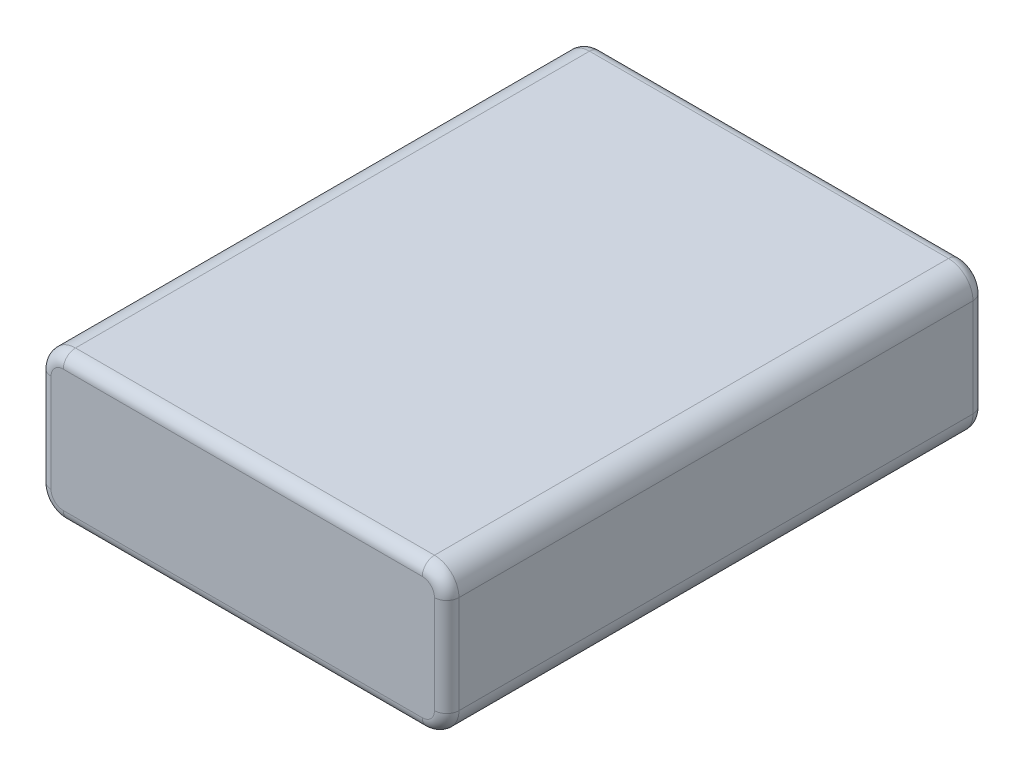
ISO-10303-21;
HEADER;
FILE_DESCRIPTION(('STEP AP214'),'2;1');
FILE_NAME('part.step','',(''),(''),'','','');
FILE_SCHEMA(('AUTOMOTIVE_DESIGN { 1 0 10303 214 1 1 1 1 }'));
ENDSEC;
DATA;
#1=APPLICATION_CONTEXT('core data for automotive mechanical design processes');
#2=APPLICATION_PROTOCOL_DEFINITION('international standard','automotive_design',2000,#1);
#3=PRODUCT_CONTEXT('',#1,'mechanical');
#4=PRODUCT('Part','Part','',(#3));
#5=PRODUCT_RELATED_PRODUCT_CATEGORY('part','',(#4));
#6=PRODUCT_DEFINITION_FORMATION('','',#4);
#7=PRODUCT_DEFINITION_CONTEXT('part definition',#1,'design');
#8=PRODUCT_DEFINITION('design','',#6,#7);
#9=PRODUCT_DEFINITION_SHAPE('','',#8);
#10=(LENGTH_UNIT() NAMED_UNIT(*) SI_UNIT(.MILLI.,.METRE.));
#11=(NAMED_UNIT(*) PLANE_ANGLE_UNIT() SI_UNIT($,.RADIAN.));
#12=(NAMED_UNIT(*) SI_UNIT($,.STERADIAN.) SOLID_ANGLE_UNIT());
#13=UNCERTAINTY_MEASURE_WITH_UNIT(LENGTH_MEASURE(1.E-05),#10,'distance_accuracy_value','');
#14=(GEOMETRIC_REPRESENTATION_CONTEXT(3) GLOBAL_UNCERTAINTY_ASSIGNED_CONTEXT((#13)) GLOBAL_UNIT_ASSIGNED_CONTEXT((#10,
#11,#12)) REPRESENTATION_CONTEXT('',''));
#15=CARTESIAN_POINT('',(0.,0.,0.));
#16=DIRECTION('',(0.,0.,1.));
#17=DIRECTION('',(1.,0.,0.));
#18=AXIS2_PLACEMENT_3D('',#15,#16,#17);
#19=CARTESIAN_POINT('',(25.,18.,0.));
#20=DIRECTION('',(-1.,0.,0.));
#21=DIRECTION('',(0.,0.,1.));
#22=AXIS2_PLACEMENT_3D('',#19,#20,#21);
#23=PLANE('',#22);
#24=DIRECTION('',(0.,0.,-1.));
#25=VECTOR('',#24,1.);
#26=CARTESIAN_POINT('',(25.,3.,0.));
#27=LINE('',#26,#25);
#28=CARTESIAN_POINT('',(25.,3.,31.5));
#29=VERTEX_POINT('',#28);
#30=CARTESIAN_POINT('',(25.,3.,-31.5));
#31=VERTEX_POINT('',#30);
#32=EDGE_CURVE('E289',#29,#31,#27,.T.);
#33=ORIENTED_EDGE('',*,*,#32,.T.);
#34=DIRECTION('',(0.,-1.,0.));
#35=VECTOR('',#34,1.);
#36=CARTESIAN_POINT('',(25.,18.,-31.5));
#37=LINE('',#36,#35);
#38=CARTESIAN_POINT('',(25.,15.,-31.5));
#39=VERTEX_POINT('',#38);
#40=EDGE_CURVE('E205',#31,#39,#37,.F.);
#41=ORIENTED_EDGE('',*,*,#40,.T.);
#42=DIRECTION('',(0.,0.,-1.));
#43=VECTOR('',#42,1.);
#44=CARTESIAN_POINT('',(25.,15.,33.));
#45=LINE('',#44,#43);
#46=CARTESIAN_POINT('',(25.,15.,31.5));
#47=VERTEX_POINT('',#46);
#48=EDGE_CURVE('E294',#39,#47,#45,.F.);
#49=ORIENTED_EDGE('',*,*,#48,.T.);
#50=DIRECTION('',(0.,-1.,0.));
#51=VECTOR('',#50,1.);
#52=CARTESIAN_POINT('',(25.,18.,31.5));
#53=LINE('',#52,#51);
#54=EDGE_CURVE('E203',#47,#29,#53,.T.);
#55=ORIENTED_EDGE('',*,*,#54,.T.);
#56=EDGE_LOOP('',(#33,#41,#49,#55));
#57=FACE_BOUND('',#56,.T.);
#58=ADVANCED_FACE('F39',(#57),#23,.F.);
#59=CARTESIAN_POINT('',(25.,18.,-33.));
#60=DIRECTION('',(0.,0.,1.));
#61=DIRECTION('',(1.,0.,0.));
#62=AXIS2_PLACEMENT_3D('',#59,#60,#61);
#63=PLANE('',#62);
#64=DIRECTION('',(0.,-1.,0.));
#65=VECTOR('',#64,1.);
#66=CARTESIAN_POINT('',(-23.5,18.,-33.));
#67=LINE('',#66,#65);
#68=CARTESIAN_POINT('',(-23.5,3.,-33.));
#69=VERTEX_POINT('',#68);
#70=CARTESIAN_POINT('',(-23.5,15.,-33.));
#71=VERTEX_POINT('',#70);
#72=EDGE_CURVE('E176',#69,#71,#67,.F.);
#73=ORIENTED_EDGE('',*,*,#72,.T.);
#74=CARTESIAN_POINT('',(-22.,15.,-33.));
#75=DIRECTION('',(0.,0.,1.));
#76=DIRECTION('',(1.,0.,0.));
#77=AXIS2_PLACEMENT_3D('',#74,#75,#76);
#78=CIRCLE('',#77,1.5);
#79=CARTESIAN_POINT('',(-22.,16.5,-33.));
#80=VERTEX_POINT('',#79);
#81=EDGE_CURVE('E157',#71,#80,#78,.F.);
#82=ORIENTED_EDGE('',*,*,#81,.T.);
#83=DIRECTION('',(-1.,0.,0.));
#84=VECTOR('',#83,1.);
#85=CARTESIAN_POINT('',(22.,16.5,-33.));
#86=LINE('',#85,#84);
#87=CARTESIAN_POINT('',(22.,16.5,-33.));
#88=VERTEX_POINT('',#87);
#89=EDGE_CURVE('E165',#80,#88,#86,.F.);
#90=ORIENTED_EDGE('',*,*,#89,.T.);
#91=CARTESIAN_POINT('',(22.,15.,-33.));
#92=DIRECTION('',(0.,0.,1.));
#93=DIRECTION('',(1.,0.,0.));
#94=AXIS2_PLACEMENT_3D('',#91,#92,#93);
#95=CIRCLE('',#94,1.5);
#96=CARTESIAN_POINT('',(23.5,15.,-33.));
#97=VERTEX_POINT('',#96);
#98=EDGE_CURVE('E171',#88,#97,#95,.F.);
#99=ORIENTED_EDGE('',*,*,#98,.T.);
#100=DIRECTION('',(0.,-1.,0.));
#101=VECTOR('',#100,1.);
#102=CARTESIAN_POINT('',(23.5,18.,-33.));
#103=LINE('',#102,#101);
#104=CARTESIAN_POINT('',(23.5,3.,-33.));
#105=VERTEX_POINT('',#104);
#106=EDGE_CURVE('E307',#97,#105,#103,.T.);
#107=ORIENTED_EDGE('',*,*,#106,.T.);
#108=CARTESIAN_POINT('',(22.,3.,-33.));
#109=DIRECTION('',(0.,0.,1.));
#110=DIRECTION('',(1.,0.,0.));
#111=AXIS2_PLACEMENT_3D('',#108,#109,#110);
#112=CIRCLE('',#111,1.5);
#113=CARTESIAN_POINT('',(22.,1.5,-33.));
#114=VERTEX_POINT('',#113);
#115=EDGE_CURVE('E309',#105,#114,#112,.F.);
#116=ORIENTED_EDGE('',*,*,#115,.T.);
#117=DIRECTION('',(-1.,0.,0.));
#118=VECTOR('',#117,1.);
#119=CARTESIAN_POINT('',(25.,1.5,-33.));
#120=LINE('',#119,#118);
#121=CARTESIAN_POINT('',(-22.,1.5,-33.));
#122=VERTEX_POINT('',#121);
#123=EDGE_CURVE('E311',#114,#122,#120,.T.);
#124=ORIENTED_EDGE('',*,*,#123,.T.);
#125=CARTESIAN_POINT('',(-22.,3.,-33.));
#126=DIRECTION('',(0.,0.,1.));
#127=DIRECTION('',(1.,0.,0.));
#128=AXIS2_PLACEMENT_3D('',#125,#126,#127);
#129=CIRCLE('',#128,1.5);
#130=EDGE_CURVE('E181',#122,#69,#129,.F.);
#131=ORIENTED_EDGE('',*,*,#130,.T.);
#132=EDGE_LOOP('',(#73,#82,#90,#99,#107,#116,#124,#131));
#133=FACE_BOUND('',#132,.T.);
#134=ADVANCED_FACE('F174',(#133),#63,.F.);
#135=CARTESIAN_POINT('',(-25.,18.,-33.));
#136=DIRECTION('',(1.,0.,0.));
#137=DIRECTION('',(0.,0.,-1.));
#138=AXIS2_PLACEMENT_3D('',#135,#136,#137);
#139=PLANE('',#138);
#140=DIRECTION('',(0.,0.,1.));
#141=VECTOR('',#140,1.);
#142=CARTESIAN_POINT('',(-25.,15.,-33.));
#143=LINE('',#142,#141);
#144=CARTESIAN_POINT('',(-25.,15.,31.5));
#145=VERTEX_POINT('',#144);
#146=CARTESIAN_POINT('',(-25.,15.,-31.5));
#147=VERTEX_POINT('',#146);
#148=EDGE_CURVE('E282',#145,#147,#143,.F.);
#149=ORIENTED_EDGE('',*,*,#148,.T.);
#150=DIRECTION('',(0.,-1.,0.));
#151=VECTOR('',#150,1.);
#152=CARTESIAN_POINT('',(-25.,18.,-31.5));
#153=LINE('',#152,#151);
#154=CARTESIAN_POINT('',(-25.,3.,-31.5));
#155=VERTEX_POINT('',#154);
#156=EDGE_CURVE('E188',#147,#155,#153,.T.);
#157=ORIENTED_EDGE('',*,*,#156,.T.);
#158=DIRECTION('',(0.,0.,1.));
#159=VECTOR('',#158,1.);
#160=CARTESIAN_POINT('',(-25.,3.,-33.));
#161=LINE('',#160,#159);
#162=CARTESIAN_POINT('',(-25.,3.,31.5));
#163=VERTEX_POINT('',#162);
#164=EDGE_CURVE('E297',#155,#163,#161,.T.);
#165=ORIENTED_EDGE('',*,*,#164,.T.);
#166=DIRECTION('',(0.,-1.,0.));
#167=VECTOR('',#166,1.);
#168=CARTESIAN_POINT('',(-25.,18.,31.5));
#169=LINE('',#168,#167);
#170=EDGE_CURVE('E186',#163,#145,#169,.F.);
#171=ORIENTED_EDGE('',*,*,#170,.T.);
#172=EDGE_LOOP('',(#149,#157,#165,#171));
#173=FACE_BOUND('',#172,.T.);
#174=ADVANCED_FACE('F324',(#173),#139,.F.);
#175=CARTESIAN_POINT('',(-25.,18.,33.));
#176=DIRECTION('',(0.,0.,-1.));
#177=DIRECTION('',(-1.,0.,0.));
#178=AXIS2_PLACEMENT_3D('',#175,#176,#177);
#179=PLANE('',#178);
#180=DIRECTION('',(1.,0.,0.));
#181=VECTOR('',#180,1.);
#182=CARTESIAN_POINT('',(-25.,1.5,33.));
#183=LINE('',#182,#181);
#184=CARTESIAN_POINT('',(-22.,1.5,33.));
#185=VERTEX_POINT('',#184);
#186=CARTESIAN_POINT('',(22.,1.5,33.));
#187=VERTEX_POINT('',#186);
#188=EDGE_CURVE('E48',#185,#187,#183,.T.);
#189=ORIENTED_EDGE('',*,*,#188,.T.);
#190=CARTESIAN_POINT('',(22.,3.,33.));
#191=DIRECTION('',(0.,0.,-1.));
#192=DIRECTION('',(-1.,0.,0.));
#193=AXIS2_PLACEMENT_3D('',#190,#191,#192);
#194=CIRCLE('',#193,1.5);
#195=CARTESIAN_POINT('',(23.5,3.,33.));
#196=VERTEX_POINT('',#195);
#197=EDGE_CURVE('E11',#187,#196,#194,.F.);
#198=ORIENTED_EDGE('',*,*,#197,.T.);
#199=DIRECTION('',(0.,-1.,0.));
#200=VECTOR('',#199,1.);
#201=CARTESIAN_POINT('',(23.5,18.,33.));
#202=LINE('',#201,#200);
#203=CARTESIAN_POINT('',(23.5,15.,33.));
#204=VERTEX_POINT('',#203);
#205=EDGE_CURVE('E215',#196,#204,#202,.F.);
#206=ORIENTED_EDGE('',*,*,#205,.T.);
#207=CARTESIAN_POINT('',(22.,15.,33.));
#208=DIRECTION('',(0.,0.,-1.));
#209=DIRECTION('',(-1.,0.,0.));
#210=AXIS2_PLACEMENT_3D('',#207,#208,#209);
#211=CIRCLE('',#210,1.5);
#212=CARTESIAN_POINT('',(22.,16.5,33.));
#213=VERTEX_POINT('',#212);
#214=EDGE_CURVE('E217',#204,#213,#211,.F.);
#215=ORIENTED_EDGE('',*,*,#214,.T.);
#216=DIRECTION('',(1.,0.,0.));
#217=VECTOR('',#216,1.);
#218=CARTESIAN_POINT('',(-22.,16.5,33.));
#219=LINE('',#218,#217);
#220=CARTESIAN_POINT('',(-22.,16.5,33.));
#221=VERTEX_POINT('',#220);
#222=EDGE_CURVE('E219',#213,#221,#219,.F.);
#223=ORIENTED_EDGE('',*,*,#222,.T.);
#224=CARTESIAN_POINT('',(-22.,15.,33.));
#225=DIRECTION('',(0.,0.,-1.));
#226=DIRECTION('',(-1.,0.,0.));
#227=AXIS2_PLACEMENT_3D('',#224,#225,#226);
#228=CIRCLE('',#227,1.5);
#229=CARTESIAN_POINT('',(-23.5,15.,33.));
#230=VERTEX_POINT('',#229);
#231=EDGE_CURVE('E221',#221,#230,#228,.F.);
#232=ORIENTED_EDGE('',*,*,#231,.T.);
#233=DIRECTION('',(0.,-1.,0.));
#234=VECTOR('',#233,1.);
#235=CARTESIAN_POINT('',(-23.5,18.,33.));
#236=LINE('',#235,#234);
#237=CARTESIAN_POINT('',(-23.5,3.,33.));
#238=VERTEX_POINT('',#237);
#239=EDGE_CURVE('E223',#230,#238,#236,.T.);
#240=ORIENTED_EDGE('',*,*,#239,.T.);
#241=CARTESIAN_POINT('',(-22.,3.,33.));
#242=DIRECTION('',(0.,0.,-1.));
#243=DIRECTION('',(-1.,0.,0.));
#244=AXIS2_PLACEMENT_3D('',#241,#242,#243);
#245=CIRCLE('',#244,1.5);
#246=EDGE_CURVE('E59',#238,#185,#245,.F.);
#247=ORIENTED_EDGE('',*,*,#246,.T.);
#248=EDGE_LOOP('',(#189,#198,#206,#215,#223,#232,#240,#247));
#249=FACE_BOUND('',#248,.T.);
#250=ADVANCED_FACE('F340',(#249),#179,.F.);
#251=CARTESIAN_POINT('',(25.,18.,-33.));
#252=DIRECTION('',(0.,1.,0.));
#253=DIRECTION('',(0.,0.,1.));
#254=AXIS2_PLACEMENT_3D('',#251,#252,#253);
#255=PLANE('',#254);
#256=DIRECTION('',(0.,0.,-1.));
#257=VECTOR('',#256,1.);
#258=CARTESIAN_POINT('',(22.,18.,-33.));
#259=LINE('',#258,#257);
#260=CARTESIAN_POINT('',(22.,18.,31.5));
#261=VERTEX_POINT('',#260);
#262=CARTESIAN_POINT('',(22.,18.,-31.5));
#263=VERTEX_POINT('',#262);
#264=EDGE_CURVE('E287',#261,#263,#259,.T.);
#265=ORIENTED_EDGE('',*,*,#264,.T.);
#266=DIRECTION('',(-1.,0.,0.));
#267=VECTOR('',#266,1.);
#268=CARTESIAN_POINT('',(-22.,18.,-31.5));
#269=LINE('',#268,#267);
#270=CARTESIAN_POINT('',(-22.,18.,-31.5));
#271=VERTEX_POINT('',#270);
#272=EDGE_CURVE('E213',#263,#271,#269,.T.);
#273=ORIENTED_EDGE('',*,*,#272,.T.);
#274=DIRECTION('',(0.,0.,1.));
#275=VECTOR('',#274,1.);
#276=CARTESIAN_POINT('',(-22.,18.,33.));
#277=LINE('',#276,#275);
#278=CARTESIAN_POINT('',(-22.,18.,31.5));
#279=VERTEX_POINT('',#278);
#280=EDGE_CURVE('E244',#271,#279,#277,.T.);
#281=ORIENTED_EDGE('',*,*,#280,.T.);
#282=DIRECTION('',(1.,0.,0.));
#283=VECTOR('',#282,1.);
#284=CARTESIAN_POINT('',(22.,18.,31.5));
#285=LINE('',#284,#283);
#286=EDGE_CURVE('E211',#279,#261,#285,.T.);
#287=ORIENTED_EDGE('',*,*,#286,.T.);
#288=EDGE_LOOP('',(#265,#273,#281,#287));
#289=FACE_BOUND('',#288,.T.);
#290=ADVANCED_FACE('F285',(#289),#255,.T.);
#291=CARTESIAN_POINT('',(25.,0.,-33.));
#292=DIRECTION('',(0.,1.,0.));
#293=DIRECTION('',(0.,0.,1.));
#294=AXIS2_PLACEMENT_3D('',#291,#292,#293);
#295=PLANE('',#294);
#296=DIRECTION('',(0.,0.,1.));
#297=VECTOR('',#296,1.);
#298=CARTESIAN_POINT('',(-22.,0.,-33.));
#299=LINE('',#298,#297);
#300=CARTESIAN_POINT('',(-22.,0.,31.5));
#301=VERTEX_POINT('',#300);
#302=CARTESIAN_POINT('',(-22.,0.,-31.5));
#303=VERTEX_POINT('',#302);
#304=EDGE_CURVE('E172',#301,#303,#299,.F.);
#305=ORIENTED_EDGE('',*,*,#304,.T.);
#306=DIRECTION('',(-1.,0.,0.));
#307=VECTOR('',#306,1.);
#308=CARTESIAN_POINT('',(25.,0.,-31.5));
#309=LINE('',#308,#307);
#310=CARTESIAN_POINT('',(22.,0.,-31.5));
#311=VERTEX_POINT('',#310);
#312=EDGE_CURVE('E196',#303,#311,#309,.F.);
#313=ORIENTED_EDGE('',*,*,#312,.T.);
#314=DIRECTION('',(0.,0.,-1.));
#315=VECTOR('',#314,1.);
#316=CARTESIAN_POINT('',(22.,0.,-33.));
#317=LINE('',#316,#315);
#318=CARTESIAN_POINT('',(22.,0.,31.5));
#319=VERTEX_POINT('',#318);
#320=EDGE_CURVE('E301',#311,#319,#317,.F.);
#321=ORIENTED_EDGE('',*,*,#320,.T.);
#322=DIRECTION('',(1.,0.,0.));
#323=VECTOR('',#322,1.);
#324=CARTESIAN_POINT('',(25.,0.,31.5));
#325=LINE('',#324,#323);
#326=EDGE_CURVE('E194',#319,#301,#325,.F.);
#327=ORIENTED_EDGE('',*,*,#326,.T.);
#328=EDGE_LOOP('',(#305,#313,#321,#327));
#329=FACE_BOUND('',#328,.T.);
#330=ADVANCED_FACE('F367',(#329),#295,.F.);
#331=CARTESIAN_POINT('',(22.,15.,-33.));
#332=DIRECTION('',(0.,0.,1.));
#333=DIRECTION('',(1.,0.,0.));
#334=AXIS2_PLACEMENT_3D('',#331,#332,#333);
#335=CYLINDRICAL_SURFACE('',#334,3.);
#336=ORIENTED_EDGE('',*,*,#48,.F.);
#337=CARTESIAN_POINT('',(22.,15.,-31.5));
#338=DIRECTION('',(0.,0.,1.));
#339=DIRECTION('',(1.,0.,0.));
#340=AXIS2_PLACEMENT_3D('',#337,#338,#339);
#341=CIRCLE('',#340,3.);
#342=EDGE_CURVE('E209',#39,#263,#341,.T.);
#343=ORIENTED_EDGE('',*,*,#342,.T.);
#344=ORIENTED_EDGE('',*,*,#264,.F.);
#345=CARTESIAN_POINT('',(22.,15.,31.5));
#346=DIRECTION('',(0.,0.,-1.));
#347=DIRECTION('',(-1.,0.,0.));
#348=AXIS2_PLACEMENT_3D('',#345,#346,#347);
#349=CIRCLE('',#348,3.);
#350=EDGE_CURVE('E207',#261,#47,#349,.T.);
#351=ORIENTED_EDGE('',*,*,#350,.T.);
#352=EDGE_LOOP('',(#336,#343,#344,#351));
#353=FACE_BOUND('',#352,.T.);
#354=ADVANCED_FACE('F369',(#353),#335,.T.);
#355=CARTESIAN_POINT('',(-22.,15.,-33.));
#356=DIRECTION('',(0.,0.,-1.));
#357=DIRECTION('',(-1.,0.,0.));
#358=AXIS2_PLACEMENT_3D('',#355,#356,#357);
#359=CYLINDRICAL_SURFACE('',#358,3.);
#360=ORIENTED_EDGE('',*,*,#280,.F.);
#361=CARTESIAN_POINT('',(-22.,15.,-31.5));
#362=DIRECTION('',(0.,0.,1.));
#363=DIRECTION('',(1.,0.,0.));
#364=AXIS2_PLACEMENT_3D('',#361,#362,#363);
#365=CIRCLE('',#364,3.);
#366=EDGE_CURVE('E159',#271,#147,#365,.T.);
#367=ORIENTED_EDGE('',*,*,#366,.T.);
#368=ORIENTED_EDGE('',*,*,#148,.F.);
#369=CARTESIAN_POINT('',(-22.,15.,31.5));
#370=DIRECTION('',(0.,0.,-1.));
#371=DIRECTION('',(-1.,0.,0.));
#372=AXIS2_PLACEMENT_3D('',#369,#370,#371);
#373=CIRCLE('',#372,3.);
#374=EDGE_CURVE('E178',#145,#279,#373,.T.);
#375=ORIENTED_EDGE('',*,*,#374,.T.);
#376=EDGE_LOOP('',(#360,#367,#368,#375));
#377=FACE_BOUND('',#376,.T.);
#378=ADVANCED_FACE('F280',(#377),#359,.T.);
#379=CARTESIAN_POINT('',(-22.,3.,-33.));
#380=DIRECTION('',(0.,0.,1.));
#381=DIRECTION('',(1.,0.,0.));
#382=AXIS2_PLACEMENT_3D('',#379,#380,#381);
#383=CYLINDRICAL_SURFACE('',#382,3.);
#384=ORIENTED_EDGE('',*,*,#164,.F.);
#385=CARTESIAN_POINT('',(-22.,3.,-31.5));
#386=DIRECTION('',(0.,0.,1.));
#387=DIRECTION('',(1.,0.,0.));
#388=AXIS2_PLACEMENT_3D('',#385,#386,#387);
#389=CIRCLE('',#388,3.);
#390=EDGE_CURVE('E192',#155,#303,#389,.T.);
#391=ORIENTED_EDGE('',*,*,#390,.T.);
#392=ORIENTED_EDGE('',*,*,#304,.F.);
#393=CARTESIAN_POINT('',(-22.,3.,31.5));
#394=DIRECTION('',(0.,0.,-1.));
#395=DIRECTION('',(-1.,0.,0.));
#396=AXIS2_PLACEMENT_3D('',#393,#394,#395);
#397=CIRCLE('',#396,3.);
#398=EDGE_CURVE('E190',#301,#163,#397,.T.);
#399=ORIENTED_EDGE('',*,*,#398,.T.);
#400=EDGE_LOOP('',(#384,#391,#392,#399));
#401=FACE_BOUND('',#400,.T.);
#402=ADVANCED_FACE('F326',(#401),#383,.T.);
#403=CARTESIAN_POINT('',(22.,3.,0.));
#404=DIRECTION('',(0.,0.,-1.));
#405=DIRECTION('',(-1.,0.,0.));
#406=AXIS2_PLACEMENT_3D('',#403,#404,#405);
#407=CYLINDRICAL_SURFACE('',#406,3.);
#408=ORIENTED_EDGE('',*,*,#320,.F.);
#409=CARTESIAN_POINT('',(22.,3.,-31.5));
#410=DIRECTION('',(0.,0.,1.));
#411=DIRECTION('',(1.,0.,0.));
#412=AXIS2_PLACEMENT_3D('',#409,#410,#411);
#413=CIRCLE('',#412,3.);
#414=EDGE_CURVE('E201',#311,#31,#413,.T.);
#415=ORIENTED_EDGE('',*,*,#414,.T.);
#416=ORIENTED_EDGE('',*,*,#32,.F.);
#417=CARTESIAN_POINT('',(22.,3.,31.5));
#418=DIRECTION('',(0.,0.,-1.));
#419=DIRECTION('',(-1.,0.,0.));
#420=AXIS2_PLACEMENT_3D('',#417,#418,#419);
#421=CIRCLE('',#420,3.);
#422=EDGE_CURVE('E198',#29,#319,#421,.T.);
#423=ORIENTED_EDGE('',*,*,#422,.T.);
#424=EDGE_LOOP('',(#408,#415,#416,#423));
#425=FACE_BOUND('',#424,.T.);
#426=ADVANCED_FACE('F356',(#425),#407,.T.);
#427=CARTESIAN_POINT('',(22.,3.,-31.5));
#428=DIRECTION('',(0.,0.,1.));
#429=DIRECTION('',(1.,0.,0.));
#430=AXIS2_PLACEMENT_3D('',#427,#428,#429);
#431=DEGENERATE_TOROIDAL_SURFACE('',#430,1.5,1.5,.T.);
#432=CARTESIAN_POINT('',(23.5,3.,-31.5));
#433=DIRECTION('',(0.,1.,0.));
#434=DIRECTION('',(0.,0.,1.));
#435=AXIS2_PLACEMENT_3D('',#432,#433,#434);
#436=CIRCLE('',#435,1.5);
#437=EDGE_CURVE('E238',#31,#105,#436,.T.);
#438=ORIENTED_EDGE('',*,*,#437,.F.);
#439=ORIENTED_EDGE('',*,*,#414,.F.);
#440=CARTESIAN_POINT('',(22.,1.5,-31.5));
#441=DIRECTION('',(-1.,0.,0.));
#442=DIRECTION('',(0.,0.,1.));
#443=AXIS2_PLACEMENT_3D('',#440,#441,#442);
#444=CIRCLE('',#443,1.5);
#445=EDGE_CURVE('E241',#114,#311,#444,.T.);
#446=ORIENTED_EDGE('',*,*,#445,.F.);
#447=ORIENTED_EDGE('',*,*,#115,.F.);
#448=EDGE_LOOP('',(#438,#439,#446,#447));
#449=FACE_BOUND('',#448,.T.);
#450=ADVANCED_FACE('F360',(#449),#431,.T.);
#451=CARTESIAN_POINT('',(25.,1.5,-31.5));
#452=DIRECTION('',(-1.,0.,0.));
#453=DIRECTION('',(0.,0.,1.));
#454=AXIS2_PLACEMENT_3D('',#451,#452,#453);
#455=CYLINDRICAL_SURFACE('',#454,1.5);
#456=ORIENTED_EDGE('',*,*,#445,.T.);
#457=ORIENTED_EDGE('',*,*,#312,.F.);
#458=CARTESIAN_POINT('',(-22.,1.5,-31.5));
#459=DIRECTION('',(-1.,0.,0.));
#460=DIRECTION('',(0.,0.,1.));
#461=AXIS2_PLACEMENT_3D('',#458,#459,#460);
#462=CIRCLE('',#461,1.5);
#463=EDGE_CURVE('E235',#122,#303,#462,.T.);
#464=ORIENTED_EDGE('',*,*,#463,.F.);
#465=ORIENTED_EDGE('',*,*,#123,.F.);
#466=EDGE_LOOP('',(#456,#457,#464,#465));
#467=FACE_BOUND('',#466,.T.);
#468=ADVANCED_FACE('F365',(#467),#455,.T.);
#469=CARTESIAN_POINT('',(23.5,18.,-31.5));
#470=DIRECTION('',(0.,-1.,0.));
#471=DIRECTION('',(0.,0.,-1.));
#472=AXIS2_PLACEMENT_3D('',#469,#470,#471);
#473=CYLINDRICAL_SURFACE('',#472,1.5);
#474=ORIENTED_EDGE('',*,*,#437,.T.);
#475=ORIENTED_EDGE('',*,*,#106,.F.);
#476=CARTESIAN_POINT('',(23.5,15.,-31.5));
#477=DIRECTION('',(0.,1.,0.));
#478=DIRECTION('',(0.,0.,1.));
#479=AXIS2_PLACEMENT_3D('',#476,#477,#478);
#480=CIRCLE('',#479,1.5);
#481=EDGE_CURVE('E232',#39,#97,#480,.T.);
#482=ORIENTED_EDGE('',*,*,#481,.F.);
#483=ORIENTED_EDGE('',*,*,#40,.F.);
#484=EDGE_LOOP('',(#474,#475,#482,#483));
#485=FACE_BOUND('',#484,.T.);
#486=ADVANCED_FACE('F405',(#485),#473,.T.);
#487=CARTESIAN_POINT('',(-22.,3.,-31.5));
#488=DIRECTION('',(0.,0.,1.));
#489=DIRECTION('',(1.,0.,0.));
#490=AXIS2_PLACEMENT_3D('',#487,#488,#489);
#491=DEGENERATE_TOROIDAL_SURFACE('',#490,1.5,1.5,.T.);
#492=ORIENTED_EDGE('',*,*,#463,.T.);
#493=ORIENTED_EDGE('',*,*,#390,.F.);
#494=CARTESIAN_POINT('',(-23.5,3.,-31.5));
#495=DIRECTION('',(0.,1.,0.));
#496=DIRECTION('',(0.,0.,1.));
#497=AXIS2_PLACEMENT_3D('',#494,#495,#496);
#498=CIRCLE('',#497,1.5);
#499=EDGE_CURVE('E229',#69,#155,#498,.T.);
#500=ORIENTED_EDGE('',*,*,#499,.F.);
#501=ORIENTED_EDGE('',*,*,#130,.F.);
#502=EDGE_LOOP('',(#492,#493,#500,#501));
#503=FACE_BOUND('',#502,.T.);
#504=ADVANCED_FACE('F318',(#503),#491,.T.);
#505=CARTESIAN_POINT('',(22.,15.,-31.5));
#506=DIRECTION('',(0.,0.,1.));
#507=DIRECTION('',(1.,0.,0.));
#508=AXIS2_PLACEMENT_3D('',#505,#506,#507);
#509=DEGENERATE_TOROIDAL_SURFACE('',#508,1.5,1.5,.T.);
#510=ORIENTED_EDGE('',*,*,#481,.T.);
#511=ORIENTED_EDGE('',*,*,#98,.F.);
#512=CARTESIAN_POINT('',(22.,16.5,-31.5));
#513=DIRECTION('',(-1.,0.,0.));
#514=DIRECTION('',(0.,0.,1.));
#515=AXIS2_PLACEMENT_3D('',#512,#513,#514);
#516=CIRCLE('',#515,1.5);
#517=EDGE_CURVE('E168',#263,#88,#516,.T.);
#518=ORIENTED_EDGE('',*,*,#517,.F.);
#519=ORIENTED_EDGE('',*,*,#342,.F.);
#520=EDGE_LOOP('',(#510,#511,#518,#519));
#521=FACE_BOUND('',#520,.T.);
#522=ADVANCED_FACE('F399',(#521),#509,.T.);
#523=CARTESIAN_POINT('',(-23.5,18.,-31.5));
#524=DIRECTION('',(0.,-1.,0.));
#525=DIRECTION('',(0.,0.,-1.));
#526=AXIS2_PLACEMENT_3D('',#523,#524,#525);
#527=CYLINDRICAL_SURFACE('',#526,1.5);
#528=ORIENTED_EDGE('',*,*,#499,.T.);
#529=ORIENTED_EDGE('',*,*,#156,.F.);
#530=CARTESIAN_POINT('',(-23.5,15.,-31.5));
#531=DIRECTION('',(0.,1.,0.));
#532=DIRECTION('',(0.,0.,1.));
#533=AXIS2_PLACEMENT_3D('',#530,#531,#532);
#534=CIRCLE('',#533,1.5);
#535=EDGE_CURVE('E162',#71,#147,#534,.T.);
#536=ORIENTED_EDGE('',*,*,#535,.F.);
#537=ORIENTED_EDGE('',*,*,#72,.F.);
#538=EDGE_LOOP('',(#528,#529,#536,#537));
#539=FACE_BOUND('',#538,.T.);
#540=ADVANCED_FACE('F321',(#539),#527,.T.);
#541=CARTESIAN_POINT('',(25.,16.5,-31.5));
#542=DIRECTION('',(1.,0.,0.));
#543=DIRECTION('',(0.,0.,-1.));
#544=AXIS2_PLACEMENT_3D('',#541,#542,#543);
#545=CYLINDRICAL_SURFACE('',#544,1.5);
#546=ORIENTED_EDGE('',*,*,#517,.T.);
#547=ORIENTED_EDGE('',*,*,#89,.F.);
#548=CARTESIAN_POINT('',(-22.,16.5,-31.5));
#549=DIRECTION('',(-1.,0.,0.));
#550=DIRECTION('',(0.,0.,1.));
#551=AXIS2_PLACEMENT_3D('',#548,#549,#550);
#552=CIRCLE('',#551,1.5);
#553=EDGE_CURVE('E153',#271,#80,#552,.T.);
#554=ORIENTED_EDGE('',*,*,#553,.F.);
#555=ORIENTED_EDGE('',*,*,#272,.F.);
#556=EDGE_LOOP('',(#546,#547,#554,#555));
#557=FACE_BOUND('',#556,.T.);
#558=ADVANCED_FACE('F166',(#557),#545,.T.);
#559=CARTESIAN_POINT('',(-22.,15.,-31.5));
#560=DIRECTION('',(0.,0.,1.));
#561=DIRECTION('',(1.,0.,0.));
#562=AXIS2_PLACEMENT_3D('',#559,#560,#561);
#563=DEGENERATE_TOROIDAL_SURFACE('',#562,1.5,1.5,.T.);
#564=ORIENTED_EDGE('',*,*,#535,.T.);
#565=ORIENTED_EDGE('',*,*,#366,.F.);
#566=ORIENTED_EDGE('',*,*,#553,.T.);
#567=ORIENTED_EDGE('',*,*,#81,.F.);
#568=EDGE_LOOP('',(#564,#565,#566,#567));
#569=FACE_BOUND('',#568,.T.);
#570=ADVANCED_FACE('F155',(#569),#563,.T.);
#571=CARTESIAN_POINT('',(-22.,15.,31.5));
#572=DIRECTION('',(0.,0.,-1.));
#573=DIRECTION('',(-1.,0.,0.));
#574=AXIS2_PLACEMENT_3D('',#571,#572,#573);
#575=DEGENERATE_TOROIDAL_SURFACE('',#574,1.5,1.5,.T.);
#576=CARTESIAN_POINT('',(-22.,16.5,31.5));
#577=DIRECTION('',(1.,0.,0.));
#578=DIRECTION('',(0.,0.,-1.));
#579=AXIS2_PLACEMENT_3D('',#576,#577,#578);
#580=CIRCLE('',#579,1.5);
#581=EDGE_CURVE('E260',#279,#221,#580,.T.);
#582=ORIENTED_EDGE('',*,*,#581,.F.);
#583=ORIENTED_EDGE('',*,*,#374,.F.);
#584=CARTESIAN_POINT('',(-23.5,15.,31.5));
#585=DIRECTION('',(0.,-1.,0.));
#586=DIRECTION('',(0.,0.,-1.));
#587=AXIS2_PLACEMENT_3D('',#584,#585,#586);
#588=CIRCLE('',#587,1.5);
#589=EDGE_CURVE('E43',#230,#145,#588,.T.);
#590=ORIENTED_EDGE('',*,*,#589,.F.);
#591=ORIENTED_EDGE('',*,*,#231,.F.);
#592=EDGE_LOOP('',(#582,#583,#590,#591));
#593=FACE_BOUND('',#592,.T.);
#594=ADVANCED_FACE('F41',(#593),#575,.T.);
#595=CARTESIAN_POINT('',(-23.5,18.,31.5));
#596=DIRECTION('',(0.,-1.,0.));
#597=DIRECTION('',(0.,0.,-1.));
#598=AXIS2_PLACEMENT_3D('',#595,#596,#597);
#599=CYLINDRICAL_SURFACE('',#598,1.5);
#600=ORIENTED_EDGE('',*,*,#589,.T.);
#601=ORIENTED_EDGE('',*,*,#170,.F.);
#602=CARTESIAN_POINT('',(-23.5,3.,31.5));
#603=DIRECTION('',(0.,-1.,0.));
#604=DIRECTION('',(0.,0.,-1.));
#605=AXIS2_PLACEMENT_3D('',#602,#603,#604);
#606=CIRCLE('',#605,1.5);
#607=EDGE_CURVE('E258',#238,#163,#606,.T.);
#608=ORIENTED_EDGE('',*,*,#607,.F.);
#609=ORIENTED_EDGE('',*,*,#239,.F.);
#610=EDGE_LOOP('',(#600,#601,#608,#609));
#611=FACE_BOUND('',#610,.T.);
#612=ADVANCED_FACE('F271',(#611),#599,.T.);
#613=CARTESIAN_POINT('',(25.,16.5,31.5));
#614=DIRECTION('',(-1.,0.,0.));
#615=DIRECTION('',(0.,0.,1.));
#616=AXIS2_PLACEMENT_3D('',#613,#614,#615);
#617=CYLINDRICAL_SURFACE('',#616,1.5);
#618=ORIENTED_EDGE('',*,*,#581,.T.);
#619=ORIENTED_EDGE('',*,*,#222,.F.);
#620=CARTESIAN_POINT('',(22.,16.5,31.5));
#621=DIRECTION('',(1.,0.,0.));
#622=DIRECTION('',(0.,0.,-1.));
#623=AXIS2_PLACEMENT_3D('',#620,#621,#622);
#624=CIRCLE('',#623,1.5);
#625=EDGE_CURVE('E255',#261,#213,#624,.T.);
#626=ORIENTED_EDGE('',*,*,#625,.F.);
#627=ORIENTED_EDGE('',*,*,#286,.F.);
#628=EDGE_LOOP('',(#618,#619,#626,#627));
#629=FACE_BOUND('',#628,.T.);
#630=ADVANCED_FACE('F423',(#629),#617,.T.);
#631=CARTESIAN_POINT('',(-22.,3.,31.5));
#632=DIRECTION('',(0.,0.,-1.));
#633=DIRECTION('',(-1.,0.,0.));
#634=AXIS2_PLACEMENT_3D('',#631,#632,#633);
#635=DEGENERATE_TOROIDAL_SURFACE('',#634,1.5,1.5,.T.);
#636=ORIENTED_EDGE('',*,*,#607,.T.);
#637=ORIENTED_EDGE('',*,*,#398,.F.);
#638=CARTESIAN_POINT('',(-22.,1.5,31.5));
#639=DIRECTION('',(1.,0.,0.));
#640=DIRECTION('',(0.,0.,-1.));
#641=AXIS2_PLACEMENT_3D('',#638,#639,#640);
#642=CIRCLE('',#641,1.5);
#643=EDGE_CURVE('E252',#185,#301,#642,.T.);
#644=ORIENTED_EDGE('',*,*,#643,.F.);
#645=ORIENTED_EDGE('',*,*,#246,.F.);
#646=EDGE_LOOP('',(#636,#637,#644,#645));
#647=FACE_BOUND('',#646,.T.);
#648=ADVANCED_FACE('F330',(#647),#635,.T.);
#649=CARTESIAN_POINT('',(22.,15.,31.5));
#650=DIRECTION('',(0.,0.,-1.));
#651=DIRECTION('',(-1.,0.,0.));
#652=AXIS2_PLACEMENT_3D('',#649,#650,#651);
#653=DEGENERATE_TOROIDAL_SURFACE('',#652,1.5,1.5,.T.);
#654=ORIENTED_EDGE('',*,*,#625,.T.);
#655=ORIENTED_EDGE('',*,*,#214,.F.);
#656=CARTESIAN_POINT('',(23.5,15.,31.5));
#657=DIRECTION('',(0.,-1.,0.));
#658=DIRECTION('',(0.,0.,-1.));
#659=AXIS2_PLACEMENT_3D('',#656,#657,#658);
#660=CIRCLE('',#659,1.5);
#661=EDGE_CURVE('E249',#47,#204,#660,.T.);
#662=ORIENTED_EDGE('',*,*,#661,.F.);
#663=ORIENTED_EDGE('',*,*,#350,.F.);
#664=EDGE_LOOP('',(#654,#655,#662,#663));
#665=FACE_BOUND('',#664,.T.);
#666=ADVANCED_FACE('F345',(#665),#653,.T.);
#667=CARTESIAN_POINT('',(-25.,1.5,31.5));
#668=DIRECTION('',(1.,0.,0.));
#669=DIRECTION('',(0.,0.,-1.));
#670=AXIS2_PLACEMENT_3D('',#667,#668,#669);
#671=CYLINDRICAL_SURFACE('',#670,1.5);
#672=ORIENTED_EDGE('',*,*,#643,.T.);
#673=ORIENTED_EDGE('',*,*,#326,.F.);
#674=CARTESIAN_POINT('',(22.,1.5,31.5));
#675=DIRECTION('',(1.,0.,0.));
#676=DIRECTION('',(0.,0.,-1.));
#677=AXIS2_PLACEMENT_3D('',#674,#675,#676);
#678=CIRCLE('',#677,1.5);
#679=EDGE_CURVE('E247',#187,#319,#678,.T.);
#680=ORIENTED_EDGE('',*,*,#679,.F.);
#681=ORIENTED_EDGE('',*,*,#188,.F.);
#682=EDGE_LOOP('',(#672,#673,#680,#681));
#683=FACE_BOUND('',#682,.T.);
#684=ADVANCED_FACE('F333',(#683),#671,.T.);
#685=CARTESIAN_POINT('',(23.5,18.,31.5));
#686=DIRECTION('',(0.,-1.,0.));
#687=DIRECTION('',(0.,0.,-1.));
#688=AXIS2_PLACEMENT_3D('',#685,#686,#687);
#689=CYLINDRICAL_SURFACE('',#688,1.5);
#690=ORIENTED_EDGE('',*,*,#661,.T.);
#691=ORIENTED_EDGE('',*,*,#205,.F.);
#692=CARTESIAN_POINT('',(23.5,3.,31.5));
#693=DIRECTION('',(0.,-1.,0.));
#694=DIRECTION('',(0.,0.,-1.));
#695=AXIS2_PLACEMENT_3D('',#692,#693,#694);
#696=CIRCLE('',#695,1.5);
#697=EDGE_CURVE('E245',#29,#196,#696,.T.);
#698=ORIENTED_EDGE('',*,*,#697,.F.);
#699=ORIENTED_EDGE('',*,*,#54,.F.);
#700=EDGE_LOOP('',(#690,#691,#698,#699));
#701=FACE_BOUND('',#700,.T.);
#702=ADVANCED_FACE('F349',(#701),#689,.T.);
#703=CARTESIAN_POINT('',(22.,3.,31.5));
#704=DIRECTION('',(0.,0.,-1.));
#705=DIRECTION('',(-1.,0.,0.));
#706=AXIS2_PLACEMENT_3D('',#703,#704,#705);
#707=DEGENERATE_TOROIDAL_SURFACE('',#706,1.5,1.5,.T.);
#708=ORIENTED_EDGE('',*,*,#679,.T.);
#709=ORIENTED_EDGE('',*,*,#422,.F.);
#710=ORIENTED_EDGE('',*,*,#697,.T.);
#711=ORIENTED_EDGE('',*,*,#197,.F.);
#712=EDGE_LOOP('',(#708,#709,#710,#711));
#713=FACE_BOUND('',#712,.T.);
#714=ADVANCED_FACE('F337',(#713),#707,.T.);
#715=CLOSED_SHELL('',(#58,#134,#174,#250,#290,#330,#354,#378,#402,#426,#450,#468,#486,#504,#522,
#540,#558,#570,#594,#612,#630,#648,#666,#684,#702,#714));
#716=MANIFOLD_SOLID_BREP('B2',#715);
#717=ADVANCED_BREP_SHAPE_REPRESENTATION('',(#18,#716),#14);
#718=SHAPE_DEFINITION_REPRESENTATION(#9,#717);
ENDSEC;
END-ISO-10303-21;
